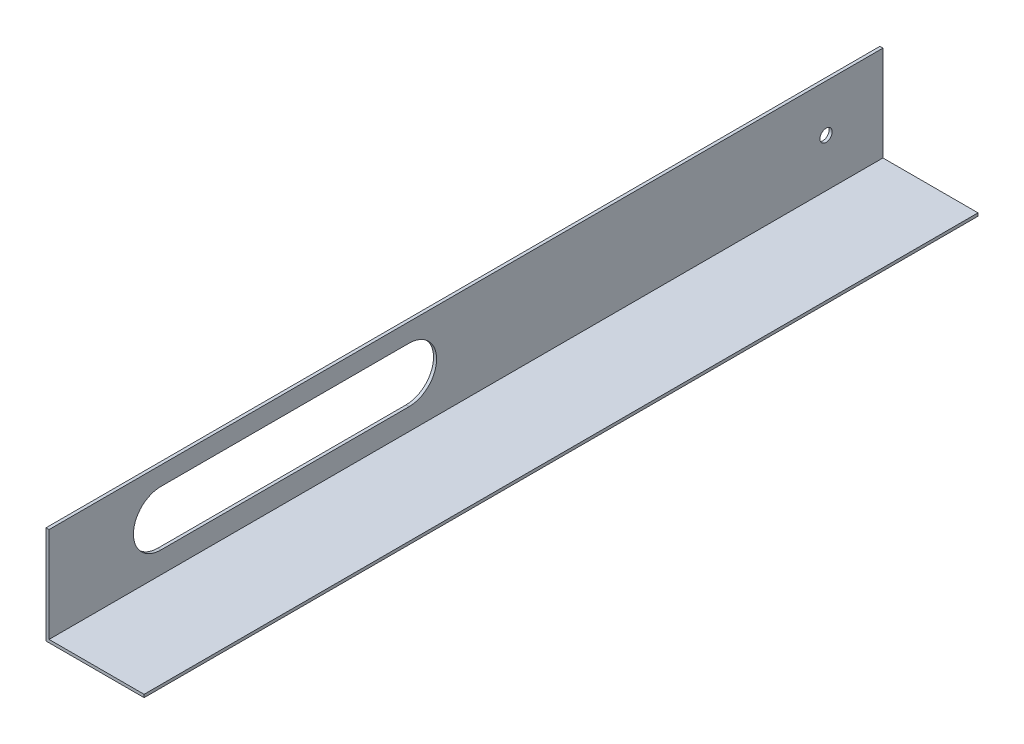
ISO-10303-21;
HEADER;
FILE_DESCRIPTION(('STEP AP214'),'2;1');
FILE_NAME('part.step','',(''),(''),'','','');
FILE_SCHEMA(('AUTOMOTIVE_DESIGN { 1 0 10303 214 1 1 1 1 }'));
ENDSEC;
DATA;
#1=APPLICATION_CONTEXT('core data for automotive mechanical design processes');
#2=APPLICATION_PROTOCOL_DEFINITION('international standard','automotive_design',2000,#1);
#3=PRODUCT_CONTEXT('',#1,'mechanical');
#4=PRODUCT('Part','Part','',(#3));
#5=PRODUCT_RELATED_PRODUCT_CATEGORY('part','',(#4));
#6=PRODUCT_DEFINITION_FORMATION('','',#4);
#7=PRODUCT_DEFINITION_CONTEXT('part definition',#1,'design');
#8=PRODUCT_DEFINITION('design','',#6,#7);
#9=PRODUCT_DEFINITION_SHAPE('','',#8);
#10=(LENGTH_UNIT() NAMED_UNIT(*) SI_UNIT(.MILLI.,.METRE.));
#11=(NAMED_UNIT(*) PLANE_ANGLE_UNIT() SI_UNIT($,.RADIAN.));
#12=(NAMED_UNIT(*) SI_UNIT($,.STERADIAN.) SOLID_ANGLE_UNIT());
#13=UNCERTAINTY_MEASURE_WITH_UNIT(LENGTH_MEASURE(1.E-05),#10,'distance_accuracy_value','');
#14=(GEOMETRIC_REPRESENTATION_CONTEXT(3) GLOBAL_UNCERTAINTY_ASSIGNED_CONTEXT((#13)) GLOBAL_UNIT_ASSIGNED_CONTEXT((#10,
#11,#12)) REPRESENTATION_CONTEXT('',''));
#15=CARTESIAN_POINT('',(0.,0.,0.));
#16=DIRECTION('',(0.,0.,1.));
#17=DIRECTION('',(1.,0.,0.));
#18=AXIS2_PLACEMENT_3D('',#15,#16,#17);
#19=CARTESIAN_POINT('',(100.0125,0.,431.8));
#20=DIRECTION('',(0.,1.,0.));
#21=DIRECTION('',(-1.,0.,0.));
#22=AXIS2_PLACEMENT_3D('',#19,#20,#21);
#23=PLANE('',#22);
#24=DIRECTION('',(1.,0.,0.));
#25=VECTOR('',#24,1.);
#26=CARTESIAN_POINT('',(100.0125,0.,0.));
#27=LINE('',#26,#25);
#28=CARTESIAN_POINT('',(49.2125,0.,0.));
#29=VERTEX_POINT('',#28);
#30=CARTESIAN_POINT('',(100.0125,0.,0.));
#31=VERTEX_POINT('',#30);
#32=EDGE_CURVE('E157',#29,#31,#27,.T.);
#33=ORIENTED_EDGE('',*,*,#32,.T.);
#34=DIRECTION('',(0.,0.,-1.));
#35=VECTOR('',#34,1.);
#36=CARTESIAN_POINT('',(100.0125,0.,431.8));
#37=LINE('',#36,#35);
#38=CARTESIAN_POINT('',(100.0125,0.,431.8));
#39=VERTEX_POINT('',#38);
#40=EDGE_CURVE('E179',#39,#31,#37,.T.);
#41=ORIENTED_EDGE('',*,*,#40,.F.);
#42=DIRECTION('',(1.,0.,0.));
#43=VECTOR('',#42,1.);
#44=CARTESIAN_POINT('',(100.0125,0.,431.8));
#45=LINE('',#44,#43);
#46=CARTESIAN_POINT('',(49.2125,0.,431.8));
#47=VERTEX_POINT('',#46);
#48=EDGE_CURVE('E144',#47,#39,#45,.T.);
#49=ORIENTED_EDGE('',*,*,#48,.F.);
#50=DIRECTION('',(0.,0.,-1.));
#51=VECTOR('',#50,1.);
#52=CARTESIAN_POINT('',(49.2125,0.,431.8));
#53=LINE('',#52,#51);
#54=EDGE_CURVE('E182',#47,#29,#53,.T.);
#55=ORIENTED_EDGE('',*,*,#54,.T.);
#56=EDGE_LOOP('',(#33,#41,#49,#55));
#57=FACE_BOUND('',#56,.T.);
#58=ADVANCED_FACE('F33',(#57),#23,.F.);
#59=CARTESIAN_POINT('',(100.0125,1.524,431.8));
#60=DIRECTION('',(-1.,0.,0.));
#61=DIRECTION('',(0.,0.,1.));
#62=AXIS2_PLACEMENT_3D('',#59,#60,#61);
#63=PLANE('',#62);
#64=DIRECTION('',(0.,1.,0.));
#65=VECTOR('',#64,1.);
#66=CARTESIAN_POINT('',(100.0125,1.524,0.));
#67=LINE('',#66,#65);
#68=CARTESIAN_POINT('',(100.0125,1.524,0.));
#69=VERTEX_POINT('',#68);
#70=EDGE_CURVE('E159',#31,#69,#67,.T.);
#71=ORIENTED_EDGE('',*,*,#70,.T.);
#72=DIRECTION('',(0.,0.,-1.));
#73=VECTOR('',#72,1.);
#74=CARTESIAN_POINT('',(100.0125,1.524,431.8));
#75=LINE('',#74,#73);
#76=CARTESIAN_POINT('',(100.0125,1.524,431.8));
#77=VERTEX_POINT('',#76);
#78=EDGE_CURVE('E176',#77,#69,#75,.T.);
#79=ORIENTED_EDGE('',*,*,#78,.F.);
#80=DIRECTION('',(0.,1.,0.));
#81=VECTOR('',#80,1.);
#82=CARTESIAN_POINT('',(100.0125,1.524,431.8));
#83=LINE('',#82,#81);
#84=EDGE_CURVE('E147',#39,#77,#83,.T.);
#85=ORIENTED_EDGE('',*,*,#84,.F.);
#86=ORIENTED_EDGE('',*,*,#40,.T.);
#87=EDGE_LOOP('',(#71,#79,#85,#86));
#88=FACE_BOUND('',#87,.T.);
#89=ADVANCED_FACE('F210',(#88),#63,.F.);
#90=CARTESIAN_POINT('',(50.8,1.524,431.8));
#91=DIRECTION('',(0.,-1.,0.));
#92=DIRECTION('',(1.,0.,0.));
#93=AXIS2_PLACEMENT_3D('',#90,#91,#92);
#94=PLANE('',#93);
#95=DIRECTION('',(-1.,0.,0.));
#96=VECTOR('',#95,1.);
#97=CARTESIAN_POINT('',(50.8,1.524,0.));
#98=LINE('',#97,#96);
#99=CARTESIAN_POINT('',(50.8,1.524,0.));
#100=VERTEX_POINT('',#99);
#101=EDGE_CURVE('E161',#69,#100,#98,.T.);
#102=ORIENTED_EDGE('',*,*,#101,.T.);
#103=DIRECTION('',(0.,0.,-1.));
#104=VECTOR('',#103,1.);
#105=CARTESIAN_POINT('',(50.8,1.524,431.8));
#106=LINE('',#105,#104);
#107=CARTESIAN_POINT('',(50.8,1.524,431.8));
#108=VERTEX_POINT('',#107);
#109=EDGE_CURVE('E173',#108,#100,#106,.T.);
#110=ORIENTED_EDGE('',*,*,#109,.F.);
#111=DIRECTION('',(-1.,0.,0.));
#112=VECTOR('',#111,1.);
#113=CARTESIAN_POINT('',(50.8,1.524,431.8));
#114=LINE('',#113,#112);
#115=EDGE_CURVE('E149',#77,#108,#114,.T.);
#116=ORIENTED_EDGE('',*,*,#115,.F.);
#117=ORIENTED_EDGE('',*,*,#78,.T.);
#118=EDGE_LOOP('',(#102,#110,#116,#117));
#119=FACE_BOUND('',#118,.T.);
#120=ADVANCED_FACE('F215',(#119),#94,.F.);
#121=CARTESIAN_POINT('',(50.8,50.8,431.8));
#122=DIRECTION('',(-1.,0.,0.));
#123=DIRECTION('',(0.,-1.,0.));
#124=AXIS2_PLACEMENT_3D('',#121,#122,#123);
#125=PLANE('',#124);
#126=DIRECTION('',(0.,0.,1.));
#127=VECTOR('',#126,1.);
#128=CARTESIAN_POINT('',(50.8,41.148,245.364));
#129=LINE('',#128,#127);
#130=CARTESIAN_POINT('',(50.8,41.148,245.364));
#131=VERTEX_POINT('',#130);
#132=CARTESIAN_POINT('',(50.8,41.148,373.888));
#133=VERTEX_POINT('',#132);
#134=EDGE_CURVE('E121',#131,#133,#129,.T.);
#135=ORIENTED_EDGE('',*,*,#134,.F.);
#136=CARTESIAN_POINT('',(50.8,26.924,245.364));
#137=DIRECTION('',(1.,0.,0.));
#138=DIRECTION('',(0.,0.,-1.));
#139=AXIS2_PLACEMENT_3D('',#136,#137,#138);
#140=CIRCLE('',#139,14.224);
#141=CARTESIAN_POINT('',(50.8,12.7,245.364));
#142=VERTEX_POINT('',#141);
#143=EDGE_CURVE('E47',#142,#131,#140,.T.);
#144=ORIENTED_EDGE('',*,*,#143,.F.);
#145=DIRECTION('',(0.,0.,-1.));
#146=VECTOR('',#145,1.);
#147=CARTESIAN_POINT('',(50.8,12.7,245.364));
#148=LINE('',#147,#146);
#149=CARTESIAN_POINT('',(50.8,12.7,373.888));
#150=VERTEX_POINT('',#149);
#151=EDGE_CURVE('E128',#150,#142,#148,.T.);
#152=ORIENTED_EDGE('',*,*,#151,.F.);
#153=CARTESIAN_POINT('',(50.8,26.924,373.888));
#154=DIRECTION('',(1.,0.,0.));
#155=DIRECTION('',(0.,0.,-1.));
#156=AXIS2_PLACEMENT_3D('',#153,#154,#155);
#157=CIRCLE('',#156,14.224);
#158=EDGE_CURVE('E112',#133,#150,#157,.T.);
#159=ORIENTED_EDGE('',*,*,#158,.F.);
#160=EDGE_LOOP('',(#135,#144,#152,#159));
#161=FACE_BOUND('',#160,.T.);
#162=CARTESIAN_POINT('',(50.8,26.416,29.464));
#163=DIRECTION('',(1.,0.,0.));
#164=DIRECTION('',(0.,0.,-1.));
#165=AXIS2_PLACEMENT_3D('',#162,#163,#164);
#166=CIRCLE('',#165,3.175);
#167=CARTESIAN_POINT('',(50.8,26.416,26.289));
#168=VERTEX_POINT('',#167);
#169=EDGE_CURVE('E138',#168,#168,#166,.T.);
#170=ORIENTED_EDGE('',*,*,#169,.F.);
#171=EDGE_LOOP('',(#170));
#172=FACE_BOUND('',#171,.T.);
#173=DIRECTION('',(0.,1.,0.));
#174=VECTOR('',#173,1.);
#175=CARTESIAN_POINT('',(50.8,50.8,0.));
#176=LINE('',#175,#174);
#177=CARTESIAN_POINT('',(50.8,50.8,0.));
#178=VERTEX_POINT('',#177);
#179=EDGE_CURVE('E163',#100,#178,#176,.T.);
#180=ORIENTED_EDGE('',*,*,#179,.T.);
#181=DIRECTION('',(0.,0.,-1.));
#182=VECTOR('',#181,1.);
#183=CARTESIAN_POINT('',(50.8,50.8,431.8));
#184=LINE('',#183,#182);
#185=CARTESIAN_POINT('',(50.8,50.8,431.8));
#186=VERTEX_POINT('',#185);
#187=EDGE_CURVE('E170',#186,#178,#184,.T.);
#188=ORIENTED_EDGE('',*,*,#187,.F.);
#189=DIRECTION('',(0.,1.,0.));
#190=VECTOR('',#189,1.);
#191=CARTESIAN_POINT('',(50.8,50.8,431.8));
#192=LINE('',#191,#190);
#193=EDGE_CURVE('E151',#108,#186,#192,.T.);
#194=ORIENTED_EDGE('',*,*,#193,.F.);
#195=ORIENTED_EDGE('',*,*,#109,.T.);
#196=EDGE_LOOP('',(#180,#188,#194,#195));
#197=FACE_BOUND('',#196,.T.);
#198=ADVANCED_FACE('F125',(#161,#172,#197),#125,.F.);
#199=CARTESIAN_POINT('',(49.2125,50.8,431.8));
#200=DIRECTION('',(0.,-1.,0.));
#201=DIRECTION('',(0.,0.,-1.));
#202=AXIS2_PLACEMENT_3D('',#199,#200,#201);
#203=PLANE('',#202);
#204=DIRECTION('',(-1.,0.,0.));
#205=VECTOR('',#204,1.);
#206=CARTESIAN_POINT('',(49.2125,50.8,0.));
#207=LINE('',#206,#205);
#208=CARTESIAN_POINT('',(49.2125,50.8,0.));
#209=VERTEX_POINT('',#208);
#210=EDGE_CURVE('E165',#178,#209,#207,.T.);
#211=ORIENTED_EDGE('',*,*,#210,.T.);
#212=DIRECTION('',(0.,0.,-1.));
#213=VECTOR('',#212,1.);
#214=CARTESIAN_POINT('',(49.2125,50.8,431.8));
#215=LINE('',#214,#213);
#216=CARTESIAN_POINT('',(49.2125,50.8,431.8));
#217=VERTEX_POINT('',#216);
#218=EDGE_CURVE('E156',#217,#209,#215,.T.);
#219=ORIENTED_EDGE('',*,*,#218,.F.);
#220=DIRECTION('',(-1.,0.,0.));
#221=VECTOR('',#220,1.);
#222=CARTESIAN_POINT('',(49.2125,50.8,431.8));
#223=LINE('',#222,#221);
#224=EDGE_CURVE('E153',#186,#217,#223,.T.);
#225=ORIENTED_EDGE('',*,*,#224,.F.);
#226=ORIENTED_EDGE('',*,*,#187,.T.);
#227=EDGE_LOOP('',(#211,#219,#225,#226));
#228=FACE_BOUND('',#227,.T.);
#229=ADVANCED_FACE('F240',(#228),#203,.F.);
#230=CARTESIAN_POINT('',(49.2125,1.58749999999999,431.8));
#231=DIRECTION('',(1.,0.,0.));
#232=DIRECTION('',(0.,0.,-1.));
#233=AXIS2_PLACEMENT_3D('',#230,#231,#232);
#234=PLANE('',#233);
#235=DIRECTION('',(0.,0.,-1.));
#236=VECTOR('',#235,1.);
#237=CARTESIAN_POINT('',(49.2125,12.7,431.8));
#238=LINE('',#237,#236);
#239=CARTESIAN_POINT('',(49.2125,12.7,373.888));
#240=VERTEX_POINT('',#239);
#241=CARTESIAN_POINT('',(49.2125,12.7,245.364));
#242=VERTEX_POINT('',#241);
#243=EDGE_CURVE('E40',#240,#242,#238,.T.);
#244=ORIENTED_EDGE('',*,*,#243,.T.);
#245=CARTESIAN_POINT('',(49.2125,26.924,245.364));
#246=DIRECTION('',(1.,0.,0.));
#247=DIRECTION('',(0.,0.,-1.));
#248=AXIS2_PLACEMENT_3D('',#245,#246,#247);
#249=CIRCLE('',#248,14.224);
#250=CARTESIAN_POINT('',(49.2125,41.148,245.364));
#251=VERTEX_POINT('',#250);
#252=EDGE_CURVE('E11',#242,#251,#249,.T.);
#253=ORIENTED_EDGE('',*,*,#252,.T.);
#254=DIRECTION('',(0.,0.,1.));
#255=VECTOR('',#254,1.);
#256=CARTESIAN_POINT('',(49.2125,41.148,431.8));
#257=LINE('',#256,#255);
#258=CARTESIAN_POINT('',(49.2125,41.148,373.888));
#259=VERTEX_POINT('',#258);
#260=EDGE_CURVE('E185',#251,#259,#257,.T.);
#261=ORIENTED_EDGE('',*,*,#260,.T.);
#262=CARTESIAN_POINT('',(49.2125,26.924,373.888));
#263=DIRECTION('',(1.,0.,0.));
#264=DIRECTION('',(0.,0.,-1.));
#265=AXIS2_PLACEMENT_3D('',#262,#263,#264);
#266=CIRCLE('',#265,14.224);
#267=EDGE_CURVE('E115',#259,#240,#266,.T.);
#268=ORIENTED_EDGE('',*,*,#267,.T.);
#269=EDGE_LOOP('',(#244,#253,#261,#268));
#270=FACE_BOUND('',#269,.T.);
#271=CARTESIAN_POINT('',(49.2125,26.416,29.464));
#272=DIRECTION('',(1.,0.,0.));
#273=DIRECTION('',(0.,0.,-1.));
#274=AXIS2_PLACEMENT_3D('',#271,#272,#273);
#275=CIRCLE('',#274,3.175);
#276=CARTESIAN_POINT('',(49.2125,26.416,26.289));
#277=VERTEX_POINT('',#276);
#278=EDGE_CURVE('E135',#277,#277,#275,.T.);
#279=ORIENTED_EDGE('',*,*,#278,.T.);
#280=EDGE_LOOP('',(#279));
#281=FACE_BOUND('',#280,.T.);
#282=DIRECTION('',(0.,-1.,0.));
#283=VECTOR('',#282,1.);
#284=CARTESIAN_POINT('',(49.2125,1.58749999999999,0.));
#285=LINE('',#284,#283);
#286=EDGE_CURVE('E145',#209,#29,#285,.T.);
#287=ORIENTED_EDGE('',*,*,#286,.T.);
#288=ORIENTED_EDGE('',*,*,#54,.F.);
#289=DIRECTION('',(0.,-1.,0.));
#290=VECTOR('',#289,1.);
#291=CARTESIAN_POINT('',(49.2125,0.,431.8));
#292=LINE('',#291,#290);
#293=EDGE_CURVE('E141',#217,#47,#292,.T.);
#294=ORIENTED_EDGE('',*,*,#293,.F.);
#295=ORIENTED_EDGE('',*,*,#218,.T.);
#296=EDGE_LOOP('',(#287,#288,#294,#295));
#297=FACE_BOUND('',#296,.T.);
#298=ADVANCED_FACE('F191',(#270,#281,#297),#234,.F.);
#299=CARTESIAN_POINT('',(0.,0.,431.8));
#300=DIRECTION('',(0.,0.,-1.));
#301=DIRECTION('',(-1.,0.,0.));
#302=AXIS2_PLACEMENT_3D('',#299,#300,#301);
#303=PLANE('',#302);
#304=ORIENTED_EDGE('',*,*,#293,.T.);
#305=ORIENTED_EDGE('',*,*,#48,.T.);
#306=ORIENTED_EDGE('',*,*,#84,.T.);
#307=ORIENTED_EDGE('',*,*,#115,.T.);
#308=ORIENTED_EDGE('',*,*,#193,.T.);
#309=ORIENTED_EDGE('',*,*,#224,.T.);
#310=EDGE_LOOP('',(#304,#305,#306,#307,#308,#309));
#311=FACE_BOUND('',#310,.T.);
#312=ADVANCED_FACE('F236',(#311),#303,.F.);
#313=CARTESIAN_POINT('',(0.,0.,0.));
#314=DIRECTION('',(0.,0.,-1.));
#315=DIRECTION('',(-1.,0.,0.));
#316=AXIS2_PLACEMENT_3D('',#313,#314,#315);
#317=PLANE('',#316);
#318=ORIENTED_EDGE('',*,*,#32,.F.);
#319=ORIENTED_EDGE('',*,*,#286,.F.);
#320=ORIENTED_EDGE('',*,*,#210,.F.);
#321=ORIENTED_EDGE('',*,*,#179,.F.);
#322=ORIENTED_EDGE('',*,*,#101,.F.);
#323=ORIENTED_EDGE('',*,*,#70,.F.);
#324=EDGE_LOOP('',(#318,#319,#320,#321,#322,#323));
#325=FACE_BOUND('',#324,.T.);
#326=ADVANCED_FACE('F205',(#325),#317,.T.);
#327=CARTESIAN_POINT('',(48.26,26.416,29.464));
#328=DIRECTION('',(1.,0.,0.));
#329=DIRECTION('',(0.,0.,-1.));
#330=AXIS2_PLACEMENT_3D('',#327,#328,#329);
#331=CYLINDRICAL_SURFACE('',#330,3.175);
#332=ORIENTED_EDGE('',*,*,#169,.T.);
#333=EDGE_LOOP('',(#332));
#334=FACE_BOUND('',#333,.T.);
#335=ORIENTED_EDGE('',*,*,#278,.F.);
#336=EDGE_LOOP('',(#335));
#337=FACE_BOUND('',#336,.T.);
#338=ADVANCED_FACE('F198',(#334,#337),#331,.F.);
#339=CARTESIAN_POINT('',(48.26,26.924,245.364));
#340=DIRECTION('',(1.,0.,0.));
#341=DIRECTION('',(0.,0.,-1.));
#342=AXIS2_PLACEMENT_3D('',#339,#340,#341);
#343=CYLINDRICAL_SURFACE('',#342,14.224);
#344=DIRECTION('',(1.,0.,0.));
#345=VECTOR('',#344,1.);
#346=CARTESIAN_POINT('',(48.26,12.7,245.364));
#347=LINE('',#346,#345);
#348=EDGE_CURVE('E133',#242,#142,#347,.T.);
#349=ORIENTED_EDGE('',*,*,#348,.T.);
#350=ORIENTED_EDGE('',*,*,#143,.T.);
#351=DIRECTION('',(1.,0.,0.));
#352=VECTOR('',#351,1.);
#353=CARTESIAN_POINT('',(48.26,41.148,245.364));
#354=LINE('',#353,#352);
#355=EDGE_CURVE('E118',#251,#131,#354,.T.);
#356=ORIENTED_EDGE('',*,*,#355,.F.);
#357=ORIENTED_EDGE('',*,*,#252,.F.);
#358=EDGE_LOOP('',(#349,#350,#356,#357));
#359=FACE_BOUND('',#358,.T.);
#360=ADVANCED_FACE('F196',(#359),#343,.F.);
#361=CARTESIAN_POINT('',(48.26,12.7,245.364));
#362=DIRECTION('',(0.,-1.,0.));
#363=DIRECTION('',(0.,0.,-1.));
#364=AXIS2_PLACEMENT_3D('',#361,#362,#363);
#365=PLANE('',#364);
#366=DIRECTION('',(1.,0.,0.));
#367=VECTOR('',#366,1.);
#368=CARTESIAN_POINT('',(48.26,12.7,373.888));
#369=LINE('',#368,#367);
#370=EDGE_CURVE('E117',#240,#150,#369,.T.);
#371=ORIENTED_EDGE('',*,*,#370,.T.);
#372=ORIENTED_EDGE('',*,*,#151,.T.);
#373=ORIENTED_EDGE('',*,*,#348,.F.);
#374=ORIENTED_EDGE('',*,*,#243,.F.);
#375=EDGE_LOOP('',(#371,#372,#373,#374));
#376=FACE_BOUND('',#375,.T.);
#377=ADVANCED_FACE('F195',(#376),#365,.F.);
#378=CARTESIAN_POINT('',(48.26,26.924,373.888));
#379=DIRECTION('',(1.,0.,0.));
#380=DIRECTION('',(0.,0.,-1.));
#381=AXIS2_PLACEMENT_3D('',#378,#379,#380);
#382=CYLINDRICAL_SURFACE('',#381,14.224);
#383=DIRECTION('',(1.,0.,0.));
#384=VECTOR('',#383,1.);
#385=CARTESIAN_POINT('',(48.26,41.148,373.888));
#386=LINE('',#385,#384);
#387=EDGE_CURVE('E55',#259,#133,#386,.T.);
#388=ORIENTED_EDGE('',*,*,#387,.T.);
#389=ORIENTED_EDGE('',*,*,#158,.T.);
#390=ORIENTED_EDGE('',*,*,#370,.F.);
#391=ORIENTED_EDGE('',*,*,#267,.F.);
#392=EDGE_LOOP('',(#388,#389,#390,#391));
#393=FACE_BOUND('',#392,.T.);
#394=ADVANCED_FACE('F109',(#393),#382,.F.);
#395=CARTESIAN_POINT('',(48.26,41.148,245.364));
#396=DIRECTION('',(0.,1.,0.));
#397=DIRECTION('',(0.,0.,1.));
#398=AXIS2_PLACEMENT_3D('',#395,#396,#397);
#399=PLANE('',#398);
#400=ORIENTED_EDGE('',*,*,#355,.T.);
#401=ORIENTED_EDGE('',*,*,#134,.T.);
#402=ORIENTED_EDGE('',*,*,#387,.F.);
#403=ORIENTED_EDGE('',*,*,#260,.F.);
#404=EDGE_LOOP('',(#400,#401,#402,#403));
#405=FACE_BOUND('',#404,.T.);
#406=ADVANCED_FACE('F122',(#405),#399,.F.);
#407=CLOSED_SHELL('',(#58,#89,#120,#198,#229,#298,#312,#326,#338,#360,#377,#394,#406));
#408=MANIFOLD_SOLID_BREP('B2',#407);
#409=ADVANCED_BREP_SHAPE_REPRESENTATION('',(#18,#408),#14);
#410=SHAPE_DEFINITION_REPRESENTATION(#9,#409);
ENDSEC;
END-ISO-10303-21;
